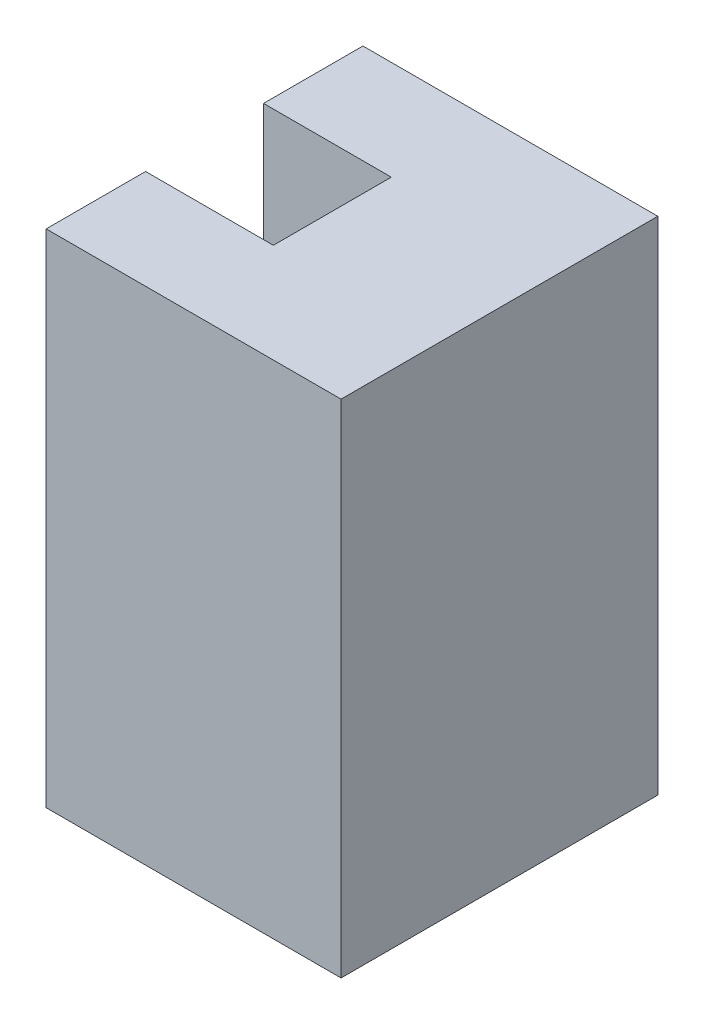
ISO-10303-21;
HEADER;
FILE_DESCRIPTION(('STEP AP214'),'2;1');
FILE_NAME('part.step','',(''),(''),'','','');
FILE_SCHEMA(('AUTOMOTIVE_DESIGN { 1 0 10303 214 1 1 1 1 }'));
ENDSEC;
DATA;
#1=APPLICATION_CONTEXT('core data for automotive mechanical design processes');
#2=APPLICATION_PROTOCOL_DEFINITION('international standard','automotive_design',2000,#1);
#3=PRODUCT_CONTEXT('',#1,'mechanical');
#4=PRODUCT('Part','Part','',(#3));
#5=PRODUCT_RELATED_PRODUCT_CATEGORY('part','',(#4));
#6=PRODUCT_DEFINITION_FORMATION('','',#4);
#7=PRODUCT_DEFINITION_CONTEXT('part definition',#1,'design');
#8=PRODUCT_DEFINITION('design','',#6,#7);
#9=PRODUCT_DEFINITION_SHAPE('','',#8);
#10=(LENGTH_UNIT() NAMED_UNIT(*) SI_UNIT(.MILLI.,.METRE.));
#11=(NAMED_UNIT(*) PLANE_ANGLE_UNIT() SI_UNIT($,.RADIAN.));
#12=(NAMED_UNIT(*) SI_UNIT($,.STERADIAN.) SOLID_ANGLE_UNIT());
#13=UNCERTAINTY_MEASURE_WITH_UNIT(LENGTH_MEASURE(1.E-05),#10,'distance_accuracy_value','');
#14=(GEOMETRIC_REPRESENTATION_CONTEXT(3) GLOBAL_UNCERTAINTY_ASSIGNED_CONTEXT((#13)) GLOBAL_UNIT_ASSIGNED_CONTEXT((#10,
#11,#12)) REPRESENTATION_CONTEXT('',''));
#15=CARTESIAN_POINT('',(0.,0.,0.));
#16=DIRECTION('',(0.,0.,1.));
#17=DIRECTION('',(1.,0.,0.));
#18=AXIS2_PLACEMENT_3D('',#15,#16,#17);
#19=CARTESIAN_POINT('',(3.20790243318484,5.5,5.55625000000002));
#20=DIRECTION('',(0.866025403784439,0.,0.499999999999999));
#21=DIRECTION('',(0.499999999999999,0.,-0.866025403784439));
#22=AXIS2_PLACEMENT_3D('',#19,#20,#21);
#23=PLANE('',#22);
#24=DIRECTION('',(-0.499999999999999,0.,0.866025403784439));
#25=VECTOR('',#24,1.);
#26=CARTESIAN_POINT('',(3.20790243318484,0.,5.55625000000002));
#27=LINE('',#26,#25);
#28=CARTESIAN_POINT('',(6.4158048663697,0.,0.));
#29=VERTEX_POINT('',#28);
#30=CARTESIAN_POINT('',(3.20790243318484,0.,5.55625000000002));
#31=VERTEX_POINT('',#30);
#32=EDGE_CURVE('E189',#29,#31,#27,.T.);
#33=ORIENTED_EDGE('',*,*,#32,.T.);
#34=DIRECTION('',(0.,-1.,0.));
#35=VECTOR('',#34,1.);
#36=CARTESIAN_POINT('',(3.20790243318484,5.5,5.55625000000002));
#37=LINE('',#36,#35);
#38=CARTESIAN_POINT('',(3.20790243318484,5.5,5.55625000000002));
#39=VERTEX_POINT('',#38);
#40=EDGE_CURVE('E11',#39,#31,#37,.T.);
#41=ORIENTED_EDGE('',*,*,#40,.F.);
#42=DIRECTION('',(-0.499999999999999,0.,0.866025403784439));
#43=VECTOR('',#42,1.);
#44=CARTESIAN_POINT('',(3.20790243318484,5.5,5.55625000000002));
#45=LINE('',#44,#43);
#46=CARTESIAN_POINT('',(6.4158048663697,5.5,0.));
#47=VERTEX_POINT('',#46);
#48=EDGE_CURVE('E194',#47,#39,#45,.T.);
#49=ORIENTED_EDGE('',*,*,#48,.F.);
#50=DIRECTION('',(0.,-1.,0.));
#51=VECTOR('',#50,1.);
#52=CARTESIAN_POINT('',(6.4158048663697,5.5,0.));
#53=LINE('',#52,#51);
#54=EDGE_CURVE('E231',#47,#29,#53,.T.);
#55=ORIENTED_EDGE('',*,*,#54,.T.);
#56=EDGE_LOOP('',(#33,#41,#49,#55));
#57=FACE_BOUND('',#56,.T.);
#58=ADVANCED_FACE('F34',(#57),#23,.F.);
#59=CARTESIAN_POINT('',(0.,5.5,5.55625000000002));
#60=DIRECTION('',(0.,0.,1.));
#61=DIRECTION('',(1.,0.,0.));
#62=AXIS2_PLACEMENT_3D('',#59,#60,#61);
#63=PLANE('',#62);
#64=DIRECTION('',(-1.,0.,0.));
#65=VECTOR('',#64,1.);
#66=CARTESIAN_POINT('',(0.,0.,5.55625000000002));
#67=LINE('',#66,#65);
#68=CARTESIAN_POINT('',(0.,0.,5.55625000000002));
#69=VERTEX_POINT('',#68);
#70=EDGE_CURVE('E264',#31,#69,#67,.T.);
#71=ORIENTED_EDGE('',*,*,#70,.T.);
#72=DIRECTION('',(0.,-1.,0.));
#73=VECTOR('',#72,1.);
#74=CARTESIAN_POINT('',(0.,5.5,5.55625000000002));
#75=LINE('',#74,#73);
#76=CARTESIAN_POINT('',(0.,5.5,5.55625000000002));
#77=VERTEX_POINT('',#76);
#78=EDGE_CURVE('E42',#77,#69,#75,.T.);
#79=ORIENTED_EDGE('',*,*,#78,.F.);
#80=DIRECTION('',(-1.,0.,0.));
#81=VECTOR('',#80,1.);
#82=CARTESIAN_POINT('',(0.,5.5,5.55625000000002));
#83=LINE('',#82,#81);
#84=EDGE_CURVE('E102',#39,#77,#83,.T.);
#85=ORIENTED_EDGE('',*,*,#84,.F.);
#86=ORIENTED_EDGE('',*,*,#40,.T.);
#87=EDGE_LOOP('',(#71,#79,#85,#86));
#88=FACE_BOUND('',#87,.T.);
#89=ADVANCED_FACE('F287',(#88),#63,.F.);
#90=CARTESIAN_POINT('',(15.,5.5,8.05624999999999));
#91=DIRECTION('',(0.,0.,-1.));
#92=DIRECTION('',(-1.,0.,0.));
#93=AXIS2_PLACEMENT_3D('',#90,#91,#92);
#94=PLANE('',#93);
#95=DIRECTION('',(1.,0.,0.));
#96=VECTOR('',#95,1.);
#97=CARTESIAN_POINT('',(15.,0.,8.05624999999999));
#98=LINE('',#97,#96);
#99=CARTESIAN_POINT('',(0.,0.,8.05625));
#100=VERTEX_POINT('',#99);
#101=CARTESIAN_POINT('',(15.,0.,8.05624999999999));
#102=VERTEX_POINT('',#101);
#103=EDGE_CURVE('E259',#100,#102,#98,.T.);
#104=ORIENTED_EDGE('',*,*,#103,.T.);
#105=DIRECTION('',(0.,-1.,0.));
#106=VECTOR('',#105,1.);
#107=CARTESIAN_POINT('',(15.,5.5,8.05624999999999));
#108=LINE('',#107,#106);
#109=CARTESIAN_POINT('',(15.,25.5,8.05624999999999));
#110=VERTEX_POINT('',#109);
#111=EDGE_CURVE('E211',#110,#102,#108,.T.);
#112=ORIENTED_EDGE('',*,*,#111,.F.);
#113=DIRECTION('',(1.,0.,0.));
#114=VECTOR('',#113,1.);
#115=CARTESIAN_POINT('',(0.,25.5,8.05624999999999));
#116=LINE('',#115,#114);
#117=CARTESIAN_POINT('',(0.,25.5,8.05624999999999));
#118=VERTEX_POINT('',#117);
#119=EDGE_CURVE('E179',#118,#110,#116,.T.);
#120=ORIENTED_EDGE('',*,*,#119,.F.);
#121=DIRECTION('',(0.,-1.,0.));
#122=VECTOR('',#121,1.);
#123=CARTESIAN_POINT('',(0.,5.5,8.05625));
#124=LINE('',#123,#122);
#125=EDGE_CURVE('E207',#118,#100,#124,.T.);
#126=ORIENTED_EDGE('',*,*,#125,.T.);
#127=EDGE_LOOP('',(#104,#112,#120,#126));
#128=FACE_BOUND('',#127,.T.);
#129=ADVANCED_FACE('F268',(#128),#94,.F.);
#130=CARTESIAN_POINT('',(15.,5.5,-8.05624999999999));
#131=DIRECTION('',(-1.,0.,0.));
#132=DIRECTION('',(0.,0.,1.));
#133=AXIS2_PLACEMENT_3D('',#130,#131,#132);
#134=PLANE('',#133);
#135=DIRECTION('',(0.,0.,-1.));
#136=VECTOR('',#135,1.);
#137=CARTESIAN_POINT('',(15.,0.,-8.05624999999999));
#138=LINE('',#137,#136);
#139=CARTESIAN_POINT('',(15.,0.,-8.05624999999999));
#140=VERTEX_POINT('',#139);
#141=EDGE_CURVE('E253',#102,#140,#138,.T.);
#142=ORIENTED_EDGE('',*,*,#141,.T.);
#143=DIRECTION('',(0.,-1.,0.));
#144=VECTOR('',#143,1.);
#145=CARTESIAN_POINT('',(15.,5.5,-8.05624999999999));
#146=LINE('',#145,#144);
#147=CARTESIAN_POINT('',(15.,25.5,-8.05625));
#148=VERTEX_POINT('',#147);
#149=EDGE_CURVE('E218',#148,#140,#146,.T.);
#150=ORIENTED_EDGE('',*,*,#149,.F.);
#151=DIRECTION('',(0.,0.,-1.));
#152=VECTOR('',#151,1.);
#153=CARTESIAN_POINT('',(15.,25.5,-8.05625));
#154=LINE('',#153,#152);
#155=EDGE_CURVE('E183',#110,#148,#154,.T.);
#156=ORIENTED_EDGE('',*,*,#155,.F.);
#157=ORIENTED_EDGE('',*,*,#111,.T.);
#158=EDGE_LOOP('',(#142,#150,#156,#157));
#159=FACE_BOUND('',#158,.T.);
#160=ADVANCED_FACE('F269',(#159),#134,.F.);
#161=CARTESIAN_POINT('',(0.,5.5,-8.05625));
#162=DIRECTION('',(0.,0.,1.));
#163=DIRECTION('',(1.,0.,0.));
#164=AXIS2_PLACEMENT_3D('',#161,#162,#163);
#165=PLANE('',#164);
#166=DIRECTION('',(-1.,0.,0.));
#167=VECTOR('',#166,1.);
#168=CARTESIAN_POINT('',(0.,0.,-8.05625));
#169=LINE('',#168,#167);
#170=CARTESIAN_POINT('',(0.,0.,-8.05625));
#171=VERTEX_POINT('',#170);
#172=EDGE_CURVE('E246',#140,#171,#169,.T.);
#173=ORIENTED_EDGE('',*,*,#172,.T.);
#174=DIRECTION('',(0.,-1.,0.));
#175=VECTOR('',#174,1.);
#176=CARTESIAN_POINT('',(0.,5.5,-8.05625));
#177=LINE('',#176,#175);
#178=CARTESIAN_POINT('',(0.,25.5,-8.05625));
#179=VERTEX_POINT('',#178);
#180=EDGE_CURVE('E225',#179,#171,#177,.T.);
#181=ORIENTED_EDGE('',*,*,#180,.F.);
#182=DIRECTION('',(-1.,0.,0.));
#183=VECTOR('',#182,1.);
#184=CARTESIAN_POINT('',(0.,25.5,-8.05625));
#185=LINE('',#184,#183);
#186=EDGE_CURVE('E186',#148,#179,#185,.T.);
#187=ORIENTED_EDGE('',*,*,#186,.F.);
#188=ORIENTED_EDGE('',*,*,#149,.T.);
#189=EDGE_LOOP('',(#173,#181,#187,#188));
#190=FACE_BOUND('',#189,.T.);
#191=ADVANCED_FACE('F245',(#190),#165,.F.);
#192=CARTESIAN_POINT('',(0.,5.5,-5.55625000000003));
#193=DIRECTION('',(1.,0.,0.));
#194=DIRECTION('',(0.,0.,-1.));
#195=AXIS2_PLACEMENT_3D('',#192,#193,#194);
#196=PLANE('',#195);
#197=DIRECTION('',(0.,0.,1.));
#198=VECTOR('',#197,1.);
#199=CARTESIAN_POINT('',(0.,7.5,-3.));
#200=LINE('',#199,#198);
#201=CARTESIAN_POINT('',(0.,7.5,-3.));
#202=VERTEX_POINT('',#201);
#203=CARTESIAN_POINT('',(0.,7.5,3.));
#204=VERTEX_POINT('',#203);
#205=EDGE_CURVE('E162',#202,#204,#200,.T.);
#206=ORIENTED_EDGE('',*,*,#205,.F.);
#207=DIRECTION('',(0.,-1.,0.));
#208=VECTOR('',#207,1.);
#209=CARTESIAN_POINT('',(0.,25.5,-3.));
#210=LINE('',#209,#208);
#211=CARTESIAN_POINT('',(0.,25.5,-3.));
#212=VERTEX_POINT('',#211);
#213=EDGE_CURVE('E147',#212,#202,#210,.T.);
#214=ORIENTED_EDGE('',*,*,#213,.F.);
#215=DIRECTION('',(0.,0.,1.));
#216=VECTOR('',#215,1.);
#217=CARTESIAN_POINT('',(0.,25.5,-8.05625));
#218=LINE('',#217,#216);
#219=EDGE_CURVE('E176',#179,#212,#218,.T.);
#220=ORIENTED_EDGE('',*,*,#219,.F.);
#221=ORIENTED_EDGE('',*,*,#180,.T.);
#222=DIRECTION('',(0.,0.,1.));
#223=VECTOR('',#222,1.);
#224=CARTESIAN_POINT('',(0.,0.,-5.55625000000003));
#225=LINE('',#224,#223);
#226=CARTESIAN_POINT('',(0.,0.,-5.55625000000003));
#227=VERTEX_POINT('',#226);
#228=EDGE_CURVE('E255',#171,#227,#225,.T.);
#229=ORIENTED_EDGE('',*,*,#228,.T.);
#230=DIRECTION('',(0.,-1.,0.));
#231=VECTOR('',#230,1.);
#232=CARTESIAN_POINT('',(0.,5.5,-5.55625000000003));
#233=LINE('',#232,#231);
#234=CARTESIAN_POINT('',(0.,5.5,-5.55625000000003));
#235=VERTEX_POINT('',#234);
#236=EDGE_CURVE('E222',#235,#227,#233,.T.);
#237=ORIENTED_EDGE('',*,*,#236,.F.);
#238=DIRECTION('',(0.,0.,1.));
#239=VECTOR('',#238,1.);
#240=CARTESIAN_POINT('',(0.,5.5,-8.05625));
#241=LINE('',#240,#239);
#242=EDGE_CURVE('E171',#235,#77,#241,.T.);
#243=ORIENTED_EDGE('',*,*,#242,.T.);
#244=ORIENTED_EDGE('',*,*,#78,.T.);
#245=DIRECTION('',(0.,0.,1.));
#246=VECTOR('',#245,1.);
#247=CARTESIAN_POINT('',(0.,0.,8.05625));
#248=LINE('',#247,#246);
#249=EDGE_CURVE('E265',#69,#100,#248,.T.);
#250=ORIENTED_EDGE('',*,*,#249,.T.);
#251=ORIENTED_EDGE('',*,*,#125,.F.);
#252=CARTESIAN_POINT('',(0.,25.5,3.));
#253=VERTEX_POINT('',#252);
#254=EDGE_CURVE('E180',#253,#118,#218,.T.);
#255=ORIENTED_EDGE('',*,*,#254,.F.);
#256=DIRECTION('',(0.,1.,0.));
#257=VECTOR('',#256,1.);
#258=CARTESIAN_POINT('',(0.,25.5,3.));
#259=LINE('',#258,#257);
#260=EDGE_CURVE('E160',#204,#253,#259,.T.);
#261=ORIENTED_EDGE('',*,*,#260,.F.);
#262=EDGE_LOOP('',(#206,#214,#220,#221,#229,#237,#243,#244,#250,#251,#255,#261));
#263=FACE_BOUND('',#262,.T.);
#264=ADVANCED_FACE('F275',(#263),#196,.F.);
#265=CARTESIAN_POINT('',(3.20790243318484,5.5,-5.55625000000002));
#266=DIRECTION('',(0.,0.,-1.));
#267=DIRECTION('',(-1.,0.,0.));
#268=AXIS2_PLACEMENT_3D('',#265,#266,#267);
#269=PLANE('',#268);
#270=DIRECTION('',(1.,0.,0.));
#271=VECTOR('',#270,1.);
#272=CARTESIAN_POINT('',(3.20790243318484,0.,-5.55625000000002));
#273=LINE('',#272,#271);
#274=CARTESIAN_POINT('',(3.20790243318484,0.,-5.55625000000002));
#275=VERTEX_POINT('',#274);
#276=EDGE_CURVE('E257',#227,#275,#273,.T.);
#277=ORIENTED_EDGE('',*,*,#276,.T.);
#278=DIRECTION('',(0.,-1.,0.));
#279=VECTOR('',#278,1.);
#280=CARTESIAN_POINT('',(3.20790243318484,5.5,-5.55625000000002));
#281=LINE('',#280,#279);
#282=CARTESIAN_POINT('',(3.20790243318484,5.5,-5.55625000000002));
#283=VERTEX_POINT('',#282);
#284=EDGE_CURVE('E59',#283,#275,#281,.T.);
#285=ORIENTED_EDGE('',*,*,#284,.F.);
#286=DIRECTION('',(1.,0.,0.));
#287=VECTOR('',#286,1.);
#288=CARTESIAN_POINT('',(3.20790243318484,5.5,-5.55625000000002));
#289=LINE('',#288,#287);
#290=EDGE_CURVE('E203',#235,#283,#289,.T.);
#291=ORIENTED_EDGE('',*,*,#290,.F.);
#292=ORIENTED_EDGE('',*,*,#236,.T.);
#293=EDGE_LOOP('',(#277,#285,#291,#292));
#294=FACE_BOUND('',#293,.T.);
#295=ADVANCED_FACE('F262',(#294),#269,.F.);
#296=CARTESIAN_POINT('',(6.4158048663697,5.5,0.));
#297=DIRECTION('',(0.866025403784439,0.,-0.499999999999999));
#298=DIRECTION('',(-0.499999999999999,0.,-0.866025403784439));
#299=AXIS2_PLACEMENT_3D('',#296,#297,#298);
#300=PLANE('',#299);
#301=DIRECTION('',(0.499999999999999,0.,0.866025403784439));
#302=VECTOR('',#301,1.);
#303=CARTESIAN_POINT('',(6.4158048663697,0.,0.));
#304=LINE('',#303,#302);
#305=EDGE_CURVE('E95',#275,#29,#304,.T.);
#306=ORIENTED_EDGE('',*,*,#305,.T.);
#307=ORIENTED_EDGE('',*,*,#54,.F.);
#308=DIRECTION('',(0.499999999999999,0.,0.866025403784439));
#309=VECTOR('',#308,1.);
#310=CARTESIAN_POINT('',(6.4158048663697,5.5,0.));
#311=LINE('',#310,#309);
#312=EDGE_CURVE('E199',#283,#47,#311,.T.);
#313=ORIENTED_EDGE('',*,*,#312,.F.);
#314=ORIENTED_EDGE('',*,*,#284,.T.);
#315=EDGE_LOOP('',(#306,#307,#313,#314));
#316=FACE_BOUND('',#315,.T.);
#317=ADVANCED_FACE('F263',(#316),#300,.F.);
#318=CARTESIAN_POINT('',(0.,0.,0.));
#319=DIRECTION('',(0.,1.,0.));
#320=DIRECTION('',(0.,0.,1.));
#321=AXIS2_PLACEMENT_3D('',#318,#319,#320);
#322=PLANE('',#321);
#323=ORIENTED_EDGE('',*,*,#32,.F.);
#324=ORIENTED_EDGE('',*,*,#305,.F.);
#325=ORIENTED_EDGE('',*,*,#276,.F.);
#326=ORIENTED_EDGE('',*,*,#228,.F.);
#327=ORIENTED_EDGE('',*,*,#172,.F.);
#328=ORIENTED_EDGE('',*,*,#141,.F.);
#329=ORIENTED_EDGE('',*,*,#103,.F.);
#330=ORIENTED_EDGE('',*,*,#249,.F.);
#331=ORIENTED_EDGE('',*,*,#70,.F.);
#332=EDGE_LOOP('',(#323,#324,#325,#326,#327,#328,#329,#330,#331));
#333=FACE_BOUND('',#332,.T.);
#334=ADVANCED_FACE('F252',(#333),#322,.F.);
#335=CARTESIAN_POINT('',(0.,5.5,0.));
#336=DIRECTION('',(0.,1.,0.));
#337=DIRECTION('',(0.,0.,1.));
#338=AXIS2_PLACEMENT_3D('',#335,#336,#337);
#339=PLANE('',#338);
#340=ORIENTED_EDGE('',*,*,#48,.T.);
#341=ORIENTED_EDGE('',*,*,#84,.T.);
#342=ORIENTED_EDGE('',*,*,#242,.F.);
#343=ORIENTED_EDGE('',*,*,#290,.T.);
#344=ORIENTED_EDGE('',*,*,#312,.T.);
#345=EDGE_LOOP('',(#340,#341,#342,#343,#344));
#346=FACE_BOUND('',#345,.T.);
#347=ADVANCED_FACE('F327',(#346),#339,.F.);
#348=CARTESIAN_POINT('',(0.,25.5,0.));
#349=DIRECTION('',(0.,1.,0.));
#350=DIRECTION('',(0.,0.,1.));
#351=AXIS2_PLACEMENT_3D('',#348,#349,#350);
#352=PLANE('',#351);
#353=DIRECTION('',(-1.,0.,0.));
#354=VECTOR('',#353,1.);
#355=CARTESIAN_POINT('',(6.5,25.5,-3.));
#356=LINE('',#355,#354);
#357=CARTESIAN_POINT('',(6.5,25.5,-3.));
#358=VERTEX_POINT('',#357);
#359=EDGE_CURVE('E169',#358,#212,#356,.T.);
#360=ORIENTED_EDGE('',*,*,#359,.F.);
#361=DIRECTION('',(0.,0.,-1.));
#362=VECTOR('',#361,1.);
#363=CARTESIAN_POINT('',(6.5,25.5,-3.));
#364=LINE('',#363,#362);
#365=CARTESIAN_POINT('',(6.5,25.5,3.));
#366=VERTEX_POINT('',#365);
#367=EDGE_CURVE('E152',#366,#358,#364,.T.);
#368=ORIENTED_EDGE('',*,*,#367,.F.);
#369=DIRECTION('',(-1.,0.,0.));
#370=VECTOR('',#369,1.);
#371=CARTESIAN_POINT('',(6.5,25.5,3.));
#372=LINE('',#371,#370);
#373=EDGE_CURVE('E172',#366,#253,#372,.T.);
#374=ORIENTED_EDGE('',*,*,#373,.T.);
#375=ORIENTED_EDGE('',*,*,#254,.T.);
#376=ORIENTED_EDGE('',*,*,#119,.T.);
#377=ORIENTED_EDGE('',*,*,#155,.T.);
#378=ORIENTED_EDGE('',*,*,#186,.T.);
#379=ORIENTED_EDGE('',*,*,#219,.T.);
#380=EDGE_LOOP('',(#360,#368,#374,#375,#376,#377,#378,#379));
#381=FACE_BOUND('',#380,.T.);
#382=ADVANCED_FACE('F271',(#381),#352,.T.);
#383=CARTESIAN_POINT('',(6.5,25.5,-3.));
#384=DIRECTION('',(0.,0.,-1.));
#385=DIRECTION('',(-1.,0.,0.));
#386=AXIS2_PLACEMENT_3D('',#383,#384,#385);
#387=PLANE('',#386);
#388=ORIENTED_EDGE('',*,*,#213,.T.);
#389=DIRECTION('',(-1.,0.,0.));
#390=VECTOR('',#389,1.);
#391=CARTESIAN_POINT('',(6.5,7.5,-3.));
#392=LINE('',#391,#390);
#393=CARTESIAN_POINT('',(6.5,7.5,-3.));
#394=VERTEX_POINT('',#393);
#395=EDGE_CURVE('E141',#394,#202,#392,.T.);
#396=ORIENTED_EDGE('',*,*,#395,.F.);
#397=DIRECTION('',(0.,-1.,0.));
#398=VECTOR('',#397,1.);
#399=CARTESIAN_POINT('',(6.5,25.5,-3.));
#400=LINE('',#399,#398);
#401=EDGE_CURVE('E145',#358,#394,#400,.T.);
#402=ORIENTED_EDGE('',*,*,#401,.F.);
#403=ORIENTED_EDGE('',*,*,#359,.T.);
#404=EDGE_LOOP('',(#388,#396,#402,#403));
#405=FACE_BOUND('',#404,.T.);
#406=ADVANCED_FACE('F143',(#405),#387,.F.);
#407=CARTESIAN_POINT('',(6.5,25.5,3.));
#408=DIRECTION('',(0.,0.,1.));
#409=DIRECTION('',(0.,-1.,0.));
#410=AXIS2_PLACEMENT_3D('',#407,#408,#409);
#411=PLANE('',#410);
#412=ORIENTED_EDGE('',*,*,#260,.T.);
#413=ORIENTED_EDGE('',*,*,#373,.F.);
#414=DIRECTION('',(0.,1.,0.));
#415=VECTOR('',#414,1.);
#416=CARTESIAN_POINT('',(6.5,25.5,3.));
#417=LINE('',#416,#415);
#418=CARTESIAN_POINT('',(6.5,7.5,3.));
#419=VERTEX_POINT('',#418);
#420=EDGE_CURVE('E50',#419,#366,#417,.T.);
#421=ORIENTED_EDGE('',*,*,#420,.F.);
#422=DIRECTION('',(-1.,0.,0.));
#423=VECTOR('',#422,1.);
#424=CARTESIAN_POINT('',(6.5,7.5,3.));
#425=LINE('',#424,#423);
#426=EDGE_CURVE('E151',#419,#204,#425,.T.);
#427=ORIENTED_EDGE('',*,*,#426,.T.);
#428=EDGE_LOOP('',(#412,#413,#421,#427));
#429=FACE_BOUND('',#428,.T.);
#430=ADVANCED_FACE('F346',(#429),#411,.F.);
#431=CARTESIAN_POINT('',(6.5,7.5,-3.));
#432=DIRECTION('',(0.,-1.,0.));
#433=DIRECTION('',(0.,0.,-1.));
#434=AXIS2_PLACEMENT_3D('',#431,#432,#433);
#435=PLANE('',#434);
#436=ORIENTED_EDGE('',*,*,#205,.T.);
#437=ORIENTED_EDGE('',*,*,#426,.F.);
#438=DIRECTION('',(0.,0.,1.));
#439=VECTOR('',#438,1.);
#440=CARTESIAN_POINT('',(6.5,7.5,-3.));
#441=LINE('',#440,#439);
#442=EDGE_CURVE('E154',#394,#419,#441,.T.);
#443=ORIENTED_EDGE('',*,*,#442,.F.);
#444=ORIENTED_EDGE('',*,*,#395,.T.);
#445=EDGE_LOOP('',(#436,#437,#443,#444));
#446=FACE_BOUND('',#445,.T.);
#447=ADVANCED_FACE('F155',(#446),#435,.F.);
#448=CARTESIAN_POINT('',(6.5,0.,0.));
#449=DIRECTION('',(-1.,0.,0.));
#450=DIRECTION('',(0.,0.,1.));
#451=AXIS2_PLACEMENT_3D('',#448,#449,#450);
#452=PLANE('',#451);
#453=ORIENTED_EDGE('',*,*,#401,.T.);
#454=ORIENTED_EDGE('',*,*,#442,.T.);
#455=ORIENTED_EDGE('',*,*,#420,.T.);
#456=ORIENTED_EDGE('',*,*,#367,.T.);
#457=EDGE_LOOP('',(#453,#454,#455,#456));
#458=FACE_BOUND('',#457,.T.);
#459=ADVANCED_FACE('F157',(#458),#452,.T.);
#460=CLOSED_SHELL('',(#58,#89,#129,#160,#191,#264,#295,#317,#334,#347,#382,#406,#430,#447,#459));
#461=MANIFOLD_SOLID_BREP('B2',#460);
#462=ADVANCED_BREP_SHAPE_REPRESENTATION('',(#18,#461),#14);
#463=SHAPE_DEFINITION_REPRESENTATION(#9,#462);
ENDSEC;
END-ISO-10303-21;
